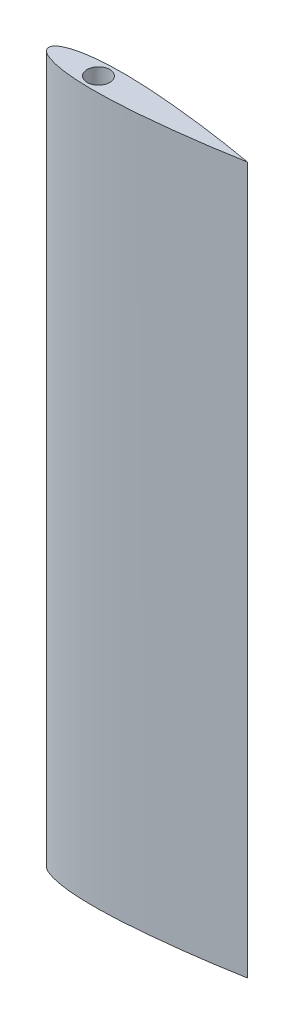
ISO-10303-21;
HEADER;
FILE_DESCRIPTION(('STEP AP214'),'2;1');
FILE_NAME('part.step','',(''),(''),'','','');
FILE_SCHEMA(('AUTOMOTIVE_DESIGN { 1 0 10303 214 1 1 1 1 }'));
ENDSEC;
DATA;
#1=APPLICATION_CONTEXT('core data for automotive mechanical design processes');
#2=APPLICATION_PROTOCOL_DEFINITION('international standard','automotive_design',2000,#1);
#3=PRODUCT_CONTEXT('',#1,'mechanical');
#4=PRODUCT('Part','Part','',(#3));
#5=PRODUCT_RELATED_PRODUCT_CATEGORY('part','',(#4));
#6=PRODUCT_DEFINITION_FORMATION('','',#4);
#7=PRODUCT_DEFINITION_CONTEXT('part definition',#1,'design');
#8=PRODUCT_DEFINITION('design','',#6,#7);
#9=PRODUCT_DEFINITION_SHAPE('','',#8);
#10=(LENGTH_UNIT() NAMED_UNIT(*) SI_UNIT(.MILLI.,.METRE.));
#11=(NAMED_UNIT(*) PLANE_ANGLE_UNIT() SI_UNIT($,.RADIAN.));
#12=(NAMED_UNIT(*) SI_UNIT($,.STERADIAN.) SOLID_ANGLE_UNIT());
#13=UNCERTAINTY_MEASURE_WITH_UNIT(LENGTH_MEASURE(1.E-05),#10,'distance_accuracy_value','');
#14=(GEOMETRIC_REPRESENTATION_CONTEXT(3) GLOBAL_UNCERTAINTY_ASSIGNED_CONTEXT((#13)) GLOBAL_UNIT_ASSIGNED_CONTEXT((#10,
#11,#12)) REPRESENTATION_CONTEXT('',''));
#15=CARTESIAN_POINT('',(0.,0.,0.));
#16=DIRECTION('',(0.,0.,1.));
#17=DIRECTION('',(1.,0.,0.));
#18=AXIS2_PLACEMENT_3D('',#15,#16,#17);
#19=CARTESIAN_POINT('',(25.4966209182363,31.75,3.47540116899455));
#20=DIRECTION('',(0.,-1.,0.));
#21=DIRECTION('',(0.,0.,-1.));
#22=AXIS2_PLACEMENT_3D('',#19,#20,#21);
#23=PLANE('',#22);
#24=CARTESIAN_POINT('',(12.9999694035506,31.75,0.));
#25=DIRECTION('',(0.,1.,0.));
#26=DIRECTION('',(0.,0.,1.));
#27=AXIS2_PLACEMENT_3D('',#24,#25,#26);
#28=CIRCLE('',#27,2.95000000004782);
#29=CARTESIAN_POINT('',(12.9999694035506,31.75,2.95000000004782));
#30=VERTEX_POINT('',#29);
#31=EDGE_CURVE('E176',#30,#30,#28,.T.);
#32=ORIENTED_EDGE('',*,*,#31,.T.);
#33=EDGE_LOOP('',(#32));
#34=FACE_BOUND('',#33,.T.);
#35=CARTESIAN_POINT('',(-4.07951993747658E-05,31.75,-1.95085248361193E-06));
#36=CARTESIAN_POINT('',(-4.0795199570006E-05,31.75,0.139276279302576));
#37=CARTESIAN_POINT('',(0.0468581097208245,31.75,0.417723169954601));
#38=CARTESIAN_POINT('',(0.240290920606621,31.7499999999999,0.792595897127917));
#39=CARTESIAN_POINT('',(0.510646173171032,31.75,1.11327044170082));
#40=CARTESIAN_POINT('',(0.826677060456423,31.75,1.38805500651467));
#41=CARTESIAN_POINT('',(1.17031607247203,31.75,1.62642121219549));
#42=CARTESIAN_POINT('',(1.6527651769989,31.75,1.90586398558623));
#43=CARTESIAN_POINT('',(2.28579130120585,31.75,2.19823689906581));
#44=CARTESIAN_POINT('',(3.07057265224324,31.7500000000001,2.48657930337849));
#45=CARTESIAN_POINT('',(3.87078810532708,31.75,2.7284209309231));
#46=CARTESIAN_POINT('',(4.68100065491605,31.75,2.93367659347665));
#47=CARTESIAN_POINT('',(5.49814965284118,31.75,3.10918101518754));
#48=CARTESIAN_POINT('',(6.3202103731536,31.75,3.25972902299613));
#49=CARTESIAN_POINT('',(7.1459235393999,31.75,3.38866969696014));
#50=CARTESIAN_POINT('',(7.97431801754735,31.75,3.49890562491557));
#51=CARTESIAN_POINT('',(9.08157091260017,31.75,3.62372338211954));
#52=CARTESIAN_POINT('',(10.469449862094,31.75,3.74239445270803));
#53=CARTESIAN_POINT('',(12.1382825500009,31.75,3.83601278494219));
#54=CARTESIAN_POINT('',(13.808880057877,31.7500000000001,3.88849278490973));
#55=CARTESIAN_POINT('',(15.4801839329417,31.7499999999999,3.90551604177455));
#56=CARTESIAN_POINT('',(17.1514995942443,31.7500000000001,3.89193588352729));
#57=CARTESIAN_POINT('',(18.8223670587582,31.7499999999999,3.85149473173316));
#58=CARTESIAN_POINT('',(20.4924866414048,31.75,3.78749734876118));
#59=CARTESIAN_POINT('',(22.7180502090953,31.75,3.67400450869664));
#60=CARTESIAN_POINT('',(25.4973283448359,31.75,3.48549054015055));
#61=CARTESIAN_POINT('',(28.8277384361378,31.75,3.19882336687818));
#62=CARTESIAN_POINT('',(32.1534156074097,31.75,2.86183669628405));
#63=CARTESIAN_POINT('',(35.4743858788434,31.75,2.48151316312112));
#64=CARTESIAN_POINT('',(39.8960814966074,31.75,1.92241515684776));
#65=CARTESIAN_POINT('',(45.4111200951892,31.75,1.13222318485411));
#66=CARTESIAN_POINT('',(49.8074736490414,31.75,0.39835463138979));
#67=CARTESIAN_POINT('',(52.0000000000001,31.75,0.));
#68=B_SPLINE_CURVE_WITH_KNOTS('',3,(#35,#36,#37,#38,#39,#40,#41,#42,#43,#44,#45,#46,#47,#48,#49,
#50,#51,#52,#53,#54,#55,#56,#57,#58,#59,#60,#61,#62,#63,#64,#65,#66,#67),.UNSPECIFIED.,.F.,.F.,
(4,1,1,1,1,1,1,1,1,1,1,1,1,1,1,1,1,1,1,1,1,1,1,1,1,1,1,1,1,1,4),(0.49999299407246,
0.503899298806269,0.507805603540078,0.511711908273887,0.515618213007696,0.519524517741505,
0.523430822475313,0.531243431942931,0.539056041410549,0.546868650878167,0.554681260345785,
0.562493869813403,0.57030647928102,0.578119088748638,0.585931698216256,0.593744307683874,
0.609369526619109,0.624994745554345,0.64061996448958,0.656245183424816,0.671870402360052,
0.687495621295288,0.703120840230523,0.718746059165759,0.74999649703623,0.781246934906701,
0.812497372777172,0.843747810647644,0.874998248518115,0.937499124259058,1.),.UNSPECIFIED.);
#69=CARTESIAN_POINT('',(-4.07951993748035E-05,31.75,-1.9508524835523E-06));
#70=VERTEX_POINT('',#69);
#71=CARTESIAN_POINT('',(52.0000000000001,31.75,0.));
#72=VERTEX_POINT('',#71);
#73=EDGE_CURVE('E82',#70,#72,#68,.T.);
#74=ORIENTED_EDGE('',*,*,#73,.F.);
#75=CARTESIAN_POINT('',(52.0000000000001,31.75,0.));
#76=CARTESIAN_POINT('',(49.8074736700273,31.75,-0.398354627576909));
#77=CARTESIAN_POINT('',(45.4111200789346,31.75,-1.13222318780736));
#78=CARTESIAN_POINT('',(39.8960815036035,31.75,-1.92241515557666));
#79=CARTESIAN_POINT('',(35.4743858759427,31.75,-2.48151316364814));
#80=CARTESIAN_POINT('',(32.1534156091599,31.75,-2.86183669596606));
#81=CARTESIAN_POINT('',(28.8277384351893,31.75,-3.19882336705051));
#82=CARTESIAN_POINT('',(25.4973283453847,31.7500000000001,-3.48549054005083));
#83=CARTESIAN_POINT('',(22.7180502088707,31.7499999999999,-3.67400450873744));
#84=CARTESIAN_POINT('',(20.4924866415136,31.7500000000001,-3.78749734874143));
#85=CARTESIAN_POINT('',(18.8223670586965,31.75,-3.85149473174436));
#86=CARTESIAN_POINT('',(17.151499594281,31.75,-3.89193588352062));
#87=CARTESIAN_POINT('',(15.4801839329195,31.75,-3.90551604177859));
#88=CARTESIAN_POINT('',(13.8088800578891,31.75,-3.88849278490753));
#89=CARTESIAN_POINT('',(12.1382825499951,31.75,-3.83601278494328));
#90=CARTESIAN_POINT('',(10.4694498620971,31.75,-3.74239445270742));
#91=CARTESIAN_POINT('',(9.08157091259868,31.75,-3.62372338211989));
#92=CARTESIAN_POINT('',(7.97431801754802,31.75,-3.49890562491532));
#93=CARTESIAN_POINT('',(7.14592353939959,31.75,-3.38866969696048));
#94=CARTESIAN_POINT('',(6.32021037315379,31.75,-3.2597290229956));
#95=CARTESIAN_POINT('',(5.49814965284109,31.75,-3.1091810151887));
#96=CARTESIAN_POINT('',(4.68100065491612,31.7500000000001,-2.93367659347386));
#97=CARTESIAN_POINT('',(3.87078810532707,31.75,-2.7284209309287));
#98=CARTESIAN_POINT('',(3.07057265224324,31.7500000000001,-2.48657930336742));
#99=CARTESIAN_POINT('',(2.28579130120583,31.75,-2.19823689908634));
#100=CARTESIAN_POINT('',(1.65276517699892,31.75,-1.90586398554853));
#101=CARTESIAN_POINT('',(1.17031607247199,31.75,-1.62642121225749));
#102=CARTESIAN_POINT('',(0.826677060456468,31.75,-1.38805500636789));
#103=CARTESIAN_POINT('',(0.510646173170942,31.75,-1.11327044198337));
#104=CARTESIAN_POINT('',(0.240290920606757,31.75,-0.792595896657961));
#105=CARTESIAN_POINT('',(0.0468581097205408,31.75,-0.417723170915954));
#106=CARTESIAN_POINT('',(-4.07951991795311E-05,31.75,-0.139276277969481));
#107=CARTESIAN_POINT('',(-4.07951993747658E-05,31.75,-1.95085248361193E-06));
#108=B_SPLINE_CURVE_WITH_KNOTS('',3,(#75,#76,#77,#78,#79,#80,#81,#82,#83,#84,#85,#86,#87,#88,
#89,#90,#91,#92,#93,#94,#95,#96,#97,#98,#99,#100,#101,#102,#103,#104,#105,#106,#107),
.UNSPECIFIED.,.F.,.F.,(4,1,1,1,1,1,1,1,1,1,1,1,1,1,1,1,1,1,1,1,1,1,1,1,1,1,1,1,1,1,4),(0.,
0.0624991242590575,0.124998248518115,0.156247810647644,0.187497372777172,0.218746934906701,
0.24999649703623,0.281246059165759,0.296870840230523,0.312495621295288,0.328120402360052,
0.343745183424816,0.35936996448958,0.374994745554345,0.390619526619109,0.406244307683874,
0.414056698216256,0.421869088748638,0.42968147928102,0.437493869813402,0.445306260345785,
0.453118650878167,0.460931041410549,0.468743431942931,0.476555822475313,0.480462017741504,
0.484368213007696,0.488274408273887,0.492180603540078,0.496086798806269,0.49999299407246),.UNSPECIFIED.);
#109=EDGE_CURVE('E85',#72,#70,#108,.T.);
#110=ORIENTED_EDGE('',*,*,#109,.F.);
#111=EDGE_LOOP('',(#74,#110));
#112=FACE_BOUND('',#111,.T.);
#113=ADVANCED_FACE('F55',(#34,#112),#23,.T.);
#114=CARTESIAN_POINT('',(25.4966209182363,216.6684,3.47540116899455));
#115=DIRECTION('',(0.,-1.,0.));
#116=DIRECTION('',(0.,0.,-1.));
#117=AXIS2_PLACEMENT_3D('',#114,#115,#116);
#118=PLANE('',#117);
#119=CARTESIAN_POINT('',(12.9999694035506,216.6684,0.));
#120=DIRECTION('',(0.,-1.,0.));
#121=DIRECTION('',(0.,0.,-1.));
#122=AXIS2_PLACEMENT_3D('',#119,#120,#121);
#123=CIRCLE('',#122,2.95000000004782);
#124=CARTESIAN_POINT('',(12.9999694035506,216.6684,-2.95000000004782));
#125=VERTEX_POINT('',#124);
#126=EDGE_CURVE('E59',#125,#125,#123,.F.);
#127=ORIENTED_EDGE('',*,*,#126,.F.);
#128=EDGE_LOOP('',(#127));
#129=FACE_BOUND('',#128,.T.);
#130=CARTESIAN_POINT('',(52.0000000000001,216.6684,0.));
#131=CARTESIAN_POINT('',(49.8074736490414,216.6684,0.39835463138979));
#132=CARTESIAN_POINT('',(45.4111200951892,216.6684,1.13222318485411));
#133=CARTESIAN_POINT('',(39.8960814966074,216.6684,1.92241515684776));
#134=CARTESIAN_POINT('',(35.4743858788434,216.6684,2.48151316312112));
#135=CARTESIAN_POINT('',(32.1534156074097,216.6684,2.86183669628405));
#136=CARTESIAN_POINT('',(28.8277384361378,216.6684,3.19882336687818));
#137=CARTESIAN_POINT('',(25.4973283448359,216.6684,3.48549054015055));
#138=CARTESIAN_POINT('',(22.7180502090953,216.6684,3.67400450869664));
#139=CARTESIAN_POINT('',(20.4924866414048,216.6684,3.78749734876118));
#140=CARTESIAN_POINT('',(18.8223670587582,216.6684,3.85149473173316));
#141=CARTESIAN_POINT('',(17.1514995942443,216.6684,3.89193588352729));
#142=CARTESIAN_POINT('',(15.4801839329417,216.6684,3.90551604177455));
#143=CARTESIAN_POINT('',(13.808880057877,216.6684,3.88849278490973));
#144=CARTESIAN_POINT('',(12.1382825500009,216.6684,3.83601278494219));
#145=CARTESIAN_POINT('',(10.469449862094,216.6684,3.74239445270803));
#146=CARTESIAN_POINT('',(9.08157091260017,216.6684,3.62372338211954));
#147=CARTESIAN_POINT('',(7.97431801754735,216.6684,3.49890562491557));
#148=CARTESIAN_POINT('',(7.1459235393999,216.6684,3.38866969696014));
#149=CARTESIAN_POINT('',(6.3202103731536,216.668400000001,3.25972902299613));
#150=CARTESIAN_POINT('',(5.49814965284118,216.6684,3.10918101518754));
#151=CARTESIAN_POINT('',(4.68100065491605,216.6684,2.93367659347665));
#152=CARTESIAN_POINT('',(3.87078810532708,216.6684,2.7284209309231));
#153=CARTESIAN_POINT('',(3.07057265224324,216.6684,2.48657930337849));
#154=CARTESIAN_POINT('',(2.28579130120585,216.6684,2.19823689906581));
#155=CARTESIAN_POINT('',(1.6527651769989,216.6684,1.90586398558623));
#156=CARTESIAN_POINT('',(1.17031607247203,216.6684,1.62642121219549));
#157=CARTESIAN_POINT('',(0.826677060456423,216.6684,1.38805500651467));
#158=CARTESIAN_POINT('',(0.510646173171032,216.6684,1.11327044170082));
#159=CARTESIAN_POINT('',(0.240290920606621,216.6684,0.792595897127917));
#160=CARTESIAN_POINT('',(0.0468581097208245,216.6684,0.417723169954601));
#161=CARTESIAN_POINT('',(-4.0795199570006E-05,216.6684,0.139276279302576));
#162=CARTESIAN_POINT('',(-4.07951993747658E-05,216.6684,-1.95085248361193E-06));
#163=B_SPLINE_CURVE_WITH_KNOTS('',3,(#130,#131,#132,#133,#134,#135,#136,#137,#138,#139,#140,
#141,#142,#143,#144,#145,#146,#147,#148,#149,#150,#151,#152,#153,#154,#155,#156,#157,#158,#159,
#160,#161,#162),.UNSPECIFIED.,.F.,.F.,(4,1,1,1,1,1,1,1,1,1,1,1,1,1,1,1,1,1,1,1,1,1,1,1,1,1,1,1,
1,1,4),(0.49999299407246,0.562493869813403,0.624994745554345,0.656245183424816,
0.687495621295288,0.718746059165759,0.74999649703623,0.781246934906701,0.796872153841937,
0.812497372777173,0.828122591712408,0.843747810647644,0.85937302958288,0.874998248518115,
0.890623467453351,0.906248686388586,0.914061295856204,0.921873905323822,0.92968651479144,
0.937499124259058,0.945311733726675,0.953124343194293,0.960936952661911,0.968749562129529,
0.976562171597147,0.980468476330956,0.984374781064765,0.988281085798573,0.992187390532382,
0.996093695266191,1.),.UNSPECIFIED.);
#164=CARTESIAN_POINT('',(-4.07951993748035E-05,216.6684,-1.9508524835523E-06));
#165=VERTEX_POINT('',#164);
#166=CARTESIAN_POINT('',(52.0000000000001,216.6684,0.));
#167=VERTEX_POINT('',#166);
#168=EDGE_CURVE('E73',#165,#167,#163,.F.);
#169=ORIENTED_EDGE('',*,*,#168,.T.);
#170=CARTESIAN_POINT('',(-4.07951993747658E-05,216.6684,-1.95085248361193E-06));
#171=CARTESIAN_POINT('',(-4.07951991795311E-05,216.6684,-0.139276277969481));
#172=CARTESIAN_POINT('',(0.0468581097205408,216.6684,-0.417723170915954));
#173=CARTESIAN_POINT('',(0.240290920606757,216.6684,-0.792595896657961));
#174=CARTESIAN_POINT('',(0.510646173170942,216.6684,-1.11327044198337));
#175=CARTESIAN_POINT('',(0.826677060456468,216.6684,-1.38805500636789));
#176=CARTESIAN_POINT('',(1.17031607247199,216.6684,-1.62642121225749));
#177=CARTESIAN_POINT('',(1.65276517699892,216.6684,-1.90586398554853));
#178=CARTESIAN_POINT('',(2.28579130120583,216.6684,-2.19823689908634));
#179=CARTESIAN_POINT('',(3.07057265224324,216.668400000001,-2.48657930336742));
#180=CARTESIAN_POINT('',(3.87078810532707,216.6684,-2.7284209309287));
#181=CARTESIAN_POINT('',(4.68100065491612,216.6684,-2.93367659347386));
#182=CARTESIAN_POINT('',(5.49814965284109,216.6684,-3.1091810151887));
#183=CARTESIAN_POINT('',(6.32021037315379,216.6684,-3.2597290229956));
#184=CARTESIAN_POINT('',(7.14592353939959,216.6684,-3.38866969696048));
#185=CARTESIAN_POINT('',(7.97431801754802,216.6684,-3.49890562491532));
#186=CARTESIAN_POINT('',(9.08157091259868,216.6684,-3.62372338211989));
#187=CARTESIAN_POINT('',(10.4694498620971,216.668400000001,-3.74239445270742));
#188=CARTESIAN_POINT('',(12.1382825499951,216.6684,-3.83601278494328));
#189=CARTESIAN_POINT('',(13.8088800578891,216.6684,-3.88849278490753));
#190=CARTESIAN_POINT('',(15.4801839329195,216.6684,-3.90551604177859));
#191=CARTESIAN_POINT('',(17.151499594281,216.6684,-3.89193588352062));
#192=CARTESIAN_POINT('',(18.8223670586965,216.6684,-3.85149473174436));
#193=CARTESIAN_POINT('',(20.4924866415136,216.6684,-3.78749734874143));
#194=CARTESIAN_POINT('',(22.7180502088707,216.668400000001,-3.67400450873744));
#195=CARTESIAN_POINT('',(25.4973283453847,216.6684,-3.48549054005083));
#196=CARTESIAN_POINT('',(28.8277384351893,216.6684,-3.19882336705051));
#197=CARTESIAN_POINT('',(32.1534156091599,216.6684,-2.86183669596606));
#198=CARTESIAN_POINT('',(35.4743858759427,216.6684,-2.48151316364814));
#199=CARTESIAN_POINT('',(39.8960815036035,216.6684,-1.92241515557666));
#200=CARTESIAN_POINT('',(45.4111200789346,216.6684,-1.13222318780736));
#201=CARTESIAN_POINT('',(49.8074736700273,216.6684,-0.398354627576909));
#202=CARTESIAN_POINT('',(52.0000000000001,216.6684,0.));
#203=B_SPLINE_CURVE_WITH_KNOTS('',3,(#170,#171,#172,#173,#174,#175,#176,#177,#178,#179,#180,
#181,#182,#183,#184,#185,#186,#187,#188,#189,#190,#191,#192,#193,#194,#195,#196,#197,#198,#199,
#200,#201,#202),.UNSPECIFIED.,.F.,.F.,(4,1,1,1,1,1,1,1,1,1,1,1,1,1,1,1,1,1,1,1,1,1,1,1,1,1,1,1,
1,1,4),(0.,0.00390619526619118,0.00781239053238231,0.0117185857985734,0.0156247810647645,
0.0195309763309556,0.0234371715971467,0.0312495621295289,0.0390619526619111,0.0468743431942933,
0.0546867337266754,0.0624991242590576,0.0703115147914398,0.0781239053238219,0.0859362958562042,
0.0937486863885864,0.109373467453351,0.124998248518115,0.14062302958288,0.156247810647644,
0.171872591712408,0.187497372777172,0.203122153841937,0.218746934906701,0.24999649703623,
0.281246059165759,0.312495621295288,0.343745183424816,0.374994745554345,0.437493869813403,
0.49999299407246),.UNSPECIFIED.);
#204=EDGE_CURVE('E96',#167,#165,#203,.F.);
#205=ORIENTED_EDGE('',*,*,#204,.T.);
#206=EDGE_LOOP('',(#169,#205));
#207=FACE_BOUND('',#206,.T.);
#208=ADVANCED_FACE('F120',(#129,#207),#118,.F.);
#209=CARTESIAN_POINT('',(52.0000000000001,31.75,0.));
#210=CARTESIAN_POINT('',(52.0000000000001,216.6684,0.));
#211=CARTESIAN_POINT('',(49.8074736700273,31.75,-0.398354627576909));
#212=CARTESIAN_POINT('',(49.8074736700273,216.6684,-0.398354627576909));
#213=CARTESIAN_POINT('',(45.4111200789346,31.75,-1.13222318780736));
#214=CARTESIAN_POINT('',(45.4111200789346,216.6684,-1.13222318780736));
#215=CARTESIAN_POINT('',(39.8960815036035,31.75,-1.92241515557666));
#216=CARTESIAN_POINT('',(39.8960815036035,216.6684,-1.92241515557666));
#217=CARTESIAN_POINT('',(35.4743858759427,31.75,-2.48151316364814));
#218=CARTESIAN_POINT('',(35.4743858759427,216.6684,-2.48151316364814));
#219=CARTESIAN_POINT('',(32.1534156091599,31.75,-2.86183669596606));
#220=CARTESIAN_POINT('',(32.1534156091599,216.6684,-2.86183669596606));
#221=CARTESIAN_POINT('',(28.8277384351893,31.75,-3.19882336705051));
#222=CARTESIAN_POINT('',(28.8277384351893,216.6684,-3.19882336705051));
#223=CARTESIAN_POINT('',(25.4973283453847,31.7500000000001,-3.48549054005083));
#224=CARTESIAN_POINT('',(25.4973283453847,216.6684,-3.48549054005083));
#225=CARTESIAN_POINT('',(22.7180502088707,31.7499999999999,-3.67400450873744));
#226=CARTESIAN_POINT('',(22.7180502088707,216.668400000001,-3.67400450873744));
#227=CARTESIAN_POINT('',(20.4924866415136,31.7500000000001,-3.78749734874143));
#228=CARTESIAN_POINT('',(20.4924866415136,216.6684,-3.78749734874143));
#229=CARTESIAN_POINT('',(18.8223670586965,31.75,-3.85149473174436));
#230=CARTESIAN_POINT('',(18.8223670586965,216.6684,-3.85149473174436));
#231=CARTESIAN_POINT('',(17.151499594281,31.75,-3.89193588352062));
#232=CARTESIAN_POINT('',(17.151499594281,216.6684,-3.89193588352062));
#233=CARTESIAN_POINT('',(15.4801839329195,31.75,-3.90551604177859));
#234=CARTESIAN_POINT('',(15.4801839329195,216.6684,-3.90551604177859));
#235=CARTESIAN_POINT('',(13.8088800578891,31.75,-3.88849278490753));
#236=CARTESIAN_POINT('',(13.8088800578891,216.6684,-3.88849278490753));
#237=CARTESIAN_POINT('',(12.1382825499951,31.75,-3.83601278494328));
#238=CARTESIAN_POINT('',(12.1382825499951,216.6684,-3.83601278494328));
#239=CARTESIAN_POINT('',(10.4694498620971,31.75,-3.74239445270742));
#240=CARTESIAN_POINT('',(10.4694498620971,216.668400000001,-3.74239445270742));
#241=CARTESIAN_POINT('',(9.08157091259868,31.75,-3.62372338211989));
#242=CARTESIAN_POINT('',(9.08157091259868,216.6684,-3.62372338211989));
#243=CARTESIAN_POINT('',(7.97431801754802,31.75,-3.49890562491532));
#244=CARTESIAN_POINT('',(7.97431801754802,216.6684,-3.49890562491532));
#245=CARTESIAN_POINT('',(7.14592353939959,31.75,-3.38866969696048));
#246=CARTESIAN_POINT('',(7.14592353939959,216.6684,-3.38866969696048));
#247=CARTESIAN_POINT('',(6.32021037315379,31.75,-3.2597290229956));
#248=CARTESIAN_POINT('',(6.32021037315379,216.6684,-3.2597290229956));
#249=CARTESIAN_POINT('',(5.49814965284109,31.75,-3.1091810151887));
#250=CARTESIAN_POINT('',(5.49814965284109,216.6684,-3.1091810151887));
#251=CARTESIAN_POINT('',(4.68100065491612,31.7500000000001,-2.93367659347386));
#252=CARTESIAN_POINT('',(4.68100065491612,216.6684,-2.93367659347386));
#253=CARTESIAN_POINT('',(3.87078810532707,31.75,-2.7284209309287));
#254=CARTESIAN_POINT('',(3.87078810532707,216.6684,-2.7284209309287));
#255=CARTESIAN_POINT('',(3.07057265224324,31.7500000000001,-2.48657930336742));
#256=CARTESIAN_POINT('',(3.07057265224324,216.668400000001,-2.48657930336742));
#257=CARTESIAN_POINT('',(2.28579130120583,31.75,-2.19823689908634));
#258=CARTESIAN_POINT('',(2.28579130120583,216.6684,-2.19823689908634));
#259=CARTESIAN_POINT('',(1.65276517699892,31.75,-1.90586398554853));
#260=CARTESIAN_POINT('',(1.65276517699892,216.6684,-1.90586398554853));
#261=CARTESIAN_POINT('',(1.17031607247199,31.75,-1.62642121225749));
#262=CARTESIAN_POINT('',(1.17031607247199,216.6684,-1.62642121225749));
#263=CARTESIAN_POINT('',(0.826677060456468,31.75,-1.38805500636789));
#264=CARTESIAN_POINT('',(0.826677060456468,216.6684,-1.38805500636789));
#265=CARTESIAN_POINT('',(0.510646173170942,31.75,-1.11327044198337));
#266=CARTESIAN_POINT('',(0.510646173170942,216.6684,-1.11327044198337));
#267=CARTESIAN_POINT('',(0.240290920606757,31.75,-0.792595896657961));
#268=CARTESIAN_POINT('',(0.240290920606757,216.6684,-0.792595896657961));
#269=CARTESIAN_POINT('',(0.0468581097205408,31.75,-0.417723170915954));
#270=CARTESIAN_POINT('',(0.0468581097205408,216.6684,-0.417723170915954));
#271=CARTESIAN_POINT('',(-4.07951991795311E-05,31.75,-0.139276277969481));
#272=CARTESIAN_POINT('',(-4.07951991795311E-05,216.6684,-0.139276277969481));
#273=CARTESIAN_POINT('',(-4.07951993747658E-05,31.75,-1.95085248361193E-06));
#274=CARTESIAN_POINT('',(-4.07951993747658E-05,216.6684,-1.95085248361193E-06));
#275=B_SPLINE_SURFACE_WITH_KNOTS('',3,1,((#209,#210),(#211,#212),(#213,#214),(#215,#216),(#217,
#218),(#219,#220),(#221,#222),(#223,#224),(#225,#226),(#227,#228),(#229,#230),(#231,#232),(#233,
#234),(#235,#236),(#237,#238),(#239,#240),(#241,#242),(#243,#244),(#245,#246),(#247,#248),(#249,
#250),(#251,#252),(#253,#254),(#255,#256),(#257,#258),(#259,#260),(#261,#262),(#263,#264),(#265,
#266),(#267,#268),(#269,#270),(#271,#272),(#273,#274)),.UNSPECIFIED.,.F.,.F.,.F.,(4,1,1,1,1,1,1,
1,1,1,1,1,1,1,1,1,1,1,1,1,1,1,1,1,1,1,1,1,1,1,4),(2,2),(0.,0.0624991242590575,0.124998248518115,
0.156247810647644,0.187497372777172,0.218746934906701,0.24999649703623,0.281246059165759,
0.296870840230523,0.312495621295288,0.328120402360052,0.343745183424816,0.35936996448958,
0.374994745554345,0.390619526619109,0.406244307683874,0.414056698216256,0.421869088748638,
0.42968147928102,0.437493869813402,0.445306260345785,0.453118650878167,0.460931041410549,
0.468743431942931,0.476555822475313,0.480462017741504,0.484368213007696,0.488274408273887,
0.492180603540078,0.496086798806269,0.49999299407246),(0.,1.),.UNSPECIFIED.);
#276=DIRECTION('',(0.,1.,0.));
#277=VECTOR('',#276,1.);
#278=CARTESIAN_POINT('',(-4.07951993747658E-05,124.2092,-1.95085248361193E-06));
#279=LINE('',#278,#277);
#280=EDGE_CURVE('E65',#70,#165,#279,.T.);
#281=DIRECTION('',(0.,1.,0.));
#282=VECTOR('',#281,1.);
#283=CARTESIAN_POINT('',(52.0000000000001,124.2092,0.));
#284=LINE('',#283,#282);
#285=EDGE_CURVE('E12',#72,#167,#284,.T.);
#286=ORIENTED_EDGE('',*,*,#109,.T.);
#287=ORIENTED_EDGE('',*,*,#280,.T.);
#288=ORIENTED_EDGE('',*,*,#204,.F.);
#289=ORIENTED_EDGE('',*,*,#285,.F.);
#290=EDGE_LOOP('',(#286,#287,#288,#289));
#291=FACE_BOUND('',#290,.T.);
#292=ADVANCED_FACE('F99',(#291),#275,.T.);
#293=CARTESIAN_POINT('',(-4.07951993747658E-05,31.75,-1.95085248361193E-06));
#294=CARTESIAN_POINT('',(-4.07951993747658E-05,216.6684,-1.95085248361193E-06));
#295=CARTESIAN_POINT('',(-4.0795199570006E-05,31.75,0.139276279302576));
#296=CARTESIAN_POINT('',(-4.0795199570006E-05,216.6684,0.139276279302576));
#297=CARTESIAN_POINT('',(0.0468581097208245,31.75,0.417723169954601));
#298=CARTESIAN_POINT('',(0.0468581097208245,216.6684,0.417723169954601));
#299=CARTESIAN_POINT('',(0.240290920606621,31.7499999999999,0.792595897127917));
#300=CARTESIAN_POINT('',(0.240290920606621,216.6684,0.792595897127917));
#301=CARTESIAN_POINT('',(0.510646173171032,31.75,1.11327044170082));
#302=CARTESIAN_POINT('',(0.510646173171032,216.6684,1.11327044170082));
#303=CARTESIAN_POINT('',(0.826677060456423,31.75,1.38805500651467));
#304=CARTESIAN_POINT('',(0.826677060456423,216.6684,1.38805500651467));
#305=CARTESIAN_POINT('',(1.17031607247203,31.75,1.62642121219549));
#306=CARTESIAN_POINT('',(1.17031607247203,216.6684,1.62642121219549));
#307=CARTESIAN_POINT('',(1.6527651769989,31.75,1.90586398558623));
#308=CARTESIAN_POINT('',(1.6527651769989,216.6684,1.90586398558623));
#309=CARTESIAN_POINT('',(2.28579130120585,31.75,2.19823689906581));
#310=CARTESIAN_POINT('',(2.28579130120585,216.6684,2.19823689906581));
#311=CARTESIAN_POINT('',(3.07057265224324,31.7500000000001,2.48657930337849));
#312=CARTESIAN_POINT('',(3.07057265224324,216.6684,2.48657930337849));
#313=CARTESIAN_POINT('',(3.87078810532708,31.75,2.7284209309231));
#314=CARTESIAN_POINT('',(3.87078810532708,216.6684,2.7284209309231));
#315=CARTESIAN_POINT('',(4.68100065491605,31.75,2.93367659347665));
#316=CARTESIAN_POINT('',(4.68100065491605,216.6684,2.93367659347665));
#317=CARTESIAN_POINT('',(5.49814965284118,31.75,3.10918101518754));
#318=CARTESIAN_POINT('',(5.49814965284118,216.6684,3.10918101518754));
#319=CARTESIAN_POINT('',(6.3202103731536,31.75,3.25972902299613));
#320=CARTESIAN_POINT('',(6.3202103731536,216.668400000001,3.25972902299613));
#321=CARTESIAN_POINT('',(7.1459235393999,31.75,3.38866969696014));
#322=CARTESIAN_POINT('',(7.1459235393999,216.6684,3.38866969696014));
#323=CARTESIAN_POINT('',(7.97431801754735,31.75,3.49890562491557));
#324=CARTESIAN_POINT('',(7.97431801754735,216.6684,3.49890562491557));
#325=CARTESIAN_POINT('',(9.08157091260017,31.75,3.62372338211954));
#326=CARTESIAN_POINT('',(9.08157091260017,216.6684,3.62372338211954));
#327=CARTESIAN_POINT('',(10.469449862094,31.75,3.74239445270803));
#328=CARTESIAN_POINT('',(10.469449862094,216.6684,3.74239445270803));
#329=CARTESIAN_POINT('',(12.1382825500009,31.75,3.83601278494219));
#330=CARTESIAN_POINT('',(12.1382825500009,216.6684,3.83601278494219));
#331=CARTESIAN_POINT('',(13.808880057877,31.7500000000001,3.88849278490973));
#332=CARTESIAN_POINT('',(13.808880057877,216.6684,3.88849278490973));
#333=CARTESIAN_POINT('',(15.4801839329417,31.7499999999999,3.90551604177455));
#334=CARTESIAN_POINT('',(15.4801839329417,216.6684,3.90551604177455));
#335=CARTESIAN_POINT('',(17.1514995942443,31.7500000000001,3.89193588352729));
#336=CARTESIAN_POINT('',(17.1514995942443,216.6684,3.89193588352729));
#337=CARTESIAN_POINT('',(18.8223670587582,31.7499999999999,3.85149473173316));
#338=CARTESIAN_POINT('',(18.8223670587582,216.6684,3.85149473173316));
#339=CARTESIAN_POINT('',(20.4924866414048,31.75,3.78749734876118));
#340=CARTESIAN_POINT('',(20.4924866414048,216.6684,3.78749734876118));
#341=CARTESIAN_POINT('',(22.7180502090953,31.75,3.67400450869664));
#342=CARTESIAN_POINT('',(22.7180502090953,216.6684,3.67400450869664));
#343=CARTESIAN_POINT('',(25.4973283448359,31.75,3.48549054015055));
#344=CARTESIAN_POINT('',(25.4973283448359,216.6684,3.48549054015055));
#345=CARTESIAN_POINT('',(28.8277384361378,31.75,3.19882336687818));
#346=CARTESIAN_POINT('',(28.8277384361378,216.6684,3.19882336687818));
#347=CARTESIAN_POINT('',(32.1534156074097,31.75,2.86183669628405));
#348=CARTESIAN_POINT('',(32.1534156074097,216.6684,2.86183669628405));
#349=CARTESIAN_POINT('',(35.4743858788434,31.75,2.48151316312112));
#350=CARTESIAN_POINT('',(35.4743858788434,216.6684,2.48151316312112));
#351=CARTESIAN_POINT('',(39.8960814966074,31.75,1.92241515684776));
#352=CARTESIAN_POINT('',(39.8960814966074,216.6684,1.92241515684776));
#353=CARTESIAN_POINT('',(45.4111200951892,31.75,1.13222318485411));
#354=CARTESIAN_POINT('',(45.4111200951892,216.6684,1.13222318485411));
#355=CARTESIAN_POINT('',(49.8074736490414,31.75,0.39835463138979));
#356=CARTESIAN_POINT('',(49.8074736490414,216.6684,0.39835463138979));
#357=CARTESIAN_POINT('',(52.0000000000001,31.75,0.));
#358=CARTESIAN_POINT('',(52.0000000000001,216.6684,0.));
#359=B_SPLINE_SURFACE_WITH_KNOTS('',3,1,((#293,#294),(#295,#296),(#297,#298),(#299,#300),(#301,
#302),(#303,#304),(#305,#306),(#307,#308),(#309,#310),(#311,#312),(#313,#314),(#315,#316),(#317,
#318),(#319,#320),(#321,#322),(#323,#324),(#325,#326),(#327,#328),(#329,#330),(#331,#332),(#333,
#334),(#335,#336),(#337,#338),(#339,#340),(#341,#342),(#343,#344),(#345,#346),(#347,#348),(#349,
#350),(#351,#352),(#353,#354),(#355,#356),(#357,#358)),.UNSPECIFIED.,.F.,.F.,.F.,(4,1,1,1,1,1,1,
1,1,1,1,1,1,1,1,1,1,1,1,1,1,1,1,1,1,1,1,1,1,1,4),(2,2),(0.49999299407246,0.503899298806269,
0.507805603540078,0.511711908273887,0.515618213007696,0.519524517741505,0.523430822475313,
0.531243431942931,0.539056041410549,0.546868650878167,0.554681260345785,0.562493869813403,
0.57030647928102,0.578119088748638,0.585931698216256,0.593744307683874,0.609369526619109,
0.624994745554345,0.64061996448958,0.656245183424816,0.671870402360052,0.687495621295288,
0.703120840230523,0.718746059165759,0.74999649703623,0.781246934906701,0.812497372777172,
0.843747810647644,0.874998248518115,0.937499124259058,1.),(0.,1.),.UNSPECIFIED.);
#360=ORIENTED_EDGE('',*,*,#73,.T.);
#361=ORIENTED_EDGE('',*,*,#285,.T.);
#362=ORIENTED_EDGE('',*,*,#168,.F.);
#363=ORIENTED_EDGE('',*,*,#280,.F.);
#364=EDGE_LOOP('',(#360,#361,#362,#363));
#365=FACE_BOUND('',#364,.T.);
#366=ADVANCED_FACE('F95',(#365),#359,.T.);
#367=CARTESIAN_POINT('',(12.9999694035506,216.670756005943,0.));
#368=DIRECTION('',(0.,-1.,0.));
#369=DIRECTION('',(0.,0.,-1.));
#370=AXIS2_PLACEMENT_3D('',#367,#368,#369);
#371=CYLINDRICAL_SURFACE('',#370,2.95000000004782);
#372=ORIENTED_EDGE('',*,*,#31,.F.);
#373=EDGE_LOOP('',(#372));
#374=FACE_BOUND('',#373,.T.);
#375=ORIENTED_EDGE('',*,*,#126,.T.);
#376=EDGE_LOOP('',(#375));
#377=FACE_BOUND('',#376,.T.);
#378=ADVANCED_FACE('F121',(#374,#377),#371,.F.);
#379=CLOSED_SHELL('',(#113,#208,#292,#366,#378));
#380=MANIFOLD_SOLID_BREP('B2',#379);
#381=ADVANCED_BREP_SHAPE_REPRESENTATION('',(#18,#380),#14);
#382=SHAPE_DEFINITION_REPRESENTATION(#9,#381);
ENDSEC;
END-ISO-10303-21;
